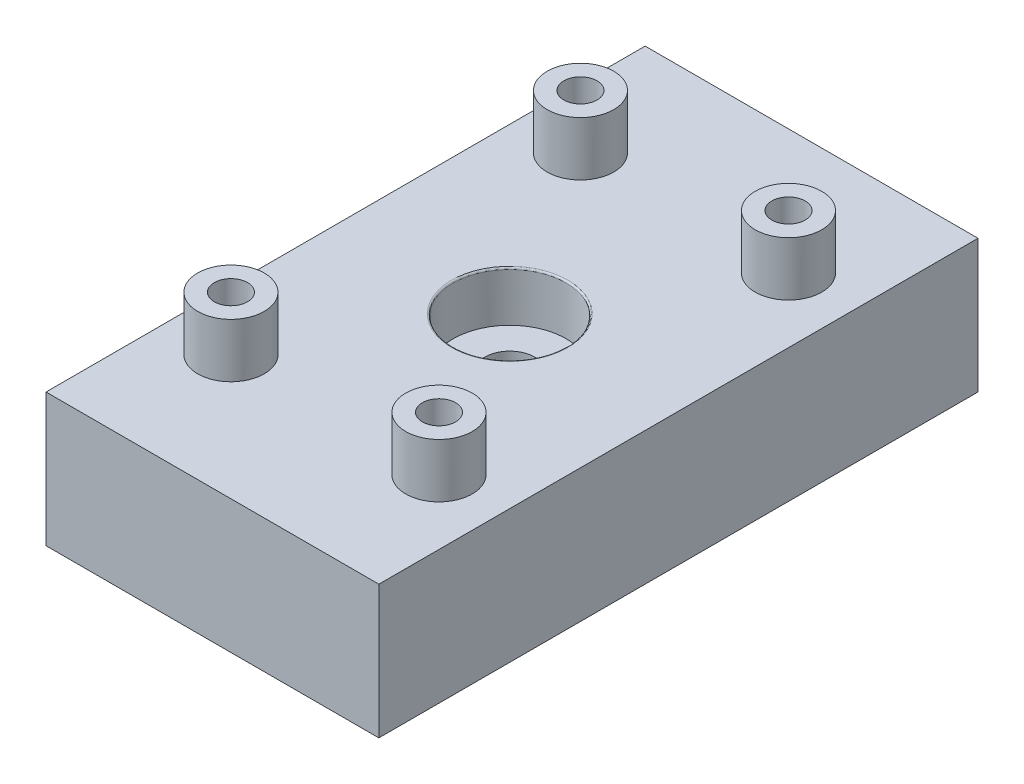
ISO-10303-21;
HEADER;
FILE_DESCRIPTION(('STEP AP214'),'2;1');
FILE_NAME('part.step','',(''),(''),'','','');
FILE_SCHEMA(('AUTOMOTIVE_DESIGN { 1 0 10303 214 1 1 1 1 }'));
ENDSEC;
DATA;
#1=APPLICATION_CONTEXT('core data for automotive mechanical design processes');
#2=APPLICATION_PROTOCOL_DEFINITION('international standard','automotive_design',2000,#1);
#3=PRODUCT_CONTEXT('',#1,'mechanical');
#4=PRODUCT('Part','Part','',(#3));
#5=PRODUCT_RELATED_PRODUCT_CATEGORY('part','',(#4));
#6=PRODUCT_DEFINITION_FORMATION('','',#4);
#7=PRODUCT_DEFINITION_CONTEXT('part definition',#1,'design');
#8=PRODUCT_DEFINITION('design','',#6,#7);
#9=PRODUCT_DEFINITION_SHAPE('','',#8);
#10=(LENGTH_UNIT() NAMED_UNIT(*) SI_UNIT(.MILLI.,.METRE.));
#11=(NAMED_UNIT(*) PLANE_ANGLE_UNIT() SI_UNIT($,.RADIAN.));
#12=(NAMED_UNIT(*) SI_UNIT($,.STERADIAN.) SOLID_ANGLE_UNIT());
#13=UNCERTAINTY_MEASURE_WITH_UNIT(LENGTH_MEASURE(1.E-05),#10,'distance_accuracy_value','');
#14=(GEOMETRIC_REPRESENTATION_CONTEXT(3) GLOBAL_UNCERTAINTY_ASSIGNED_CONTEXT((#13)) GLOBAL_UNIT_ASSIGNED_CONTEXT((#10,
#11,#12)) REPRESENTATION_CONTEXT('',''));
#15=CARTESIAN_POINT('',(0.,0.,0.));
#16=DIRECTION('',(0.,0.,1.));
#17=DIRECTION('',(1.,0.,0.));
#18=AXIS2_PLACEMENT_3D('',#15,#16,#17);
#19=CARTESIAN_POINT('',(31.0000000000001,14.4551298552221,-16.5000000000003));
#20=DIRECTION('',(0.,-1.,0.));
#21=DIRECTION('',(0.,0.,-1.));
#22=AXIS2_PLACEMENT_3D('',#19,#20,#21);
#23=CYLINDRICAL_SURFACE('',#22,1.5);
#24=CARTESIAN_POINT('',(31.0000000000001,-0.999999999999996,-16.5000000000003));
#25=DIRECTION('',(0.,-1.,0.));
#26=DIRECTION('',(0.,0.,-1.));
#27=AXIS2_PLACEMENT_3D('',#24,#25,#26);
#28=CIRCLE('',#27,1.5);
#29=CARTESIAN_POINT('',(31.0000000000001,-0.999999999999996,-18.0000000000003));
#30=VERTEX_POINT('',#29);
#31=EDGE_CURVE('E216',#30,#30,#28,.T.);
#32=ORIENTED_EDGE('',*,*,#31,.T.);
#33=EDGE_LOOP('',(#32));
#34=FACE_BOUND('',#33,.T.);
#35=CARTESIAN_POINT('',(31.0000000000001,2.,-16.5000000000003));
#36=DIRECTION('',(0.,1.,0.));
#37=DIRECTION('',(0.,0.,1.));
#38=AXIS2_PLACEMENT_3D('',#35,#36,#37);
#39=CIRCLE('',#38,1.5);
#40=CARTESIAN_POINT('',(31.0000000000001,2.,-15.0000000000002));
#41=VERTEX_POINT('',#40);
#42=EDGE_CURVE('E251',#41,#41,#39,.F.);
#43=ORIENTED_EDGE('',*,*,#42,.F.);
#44=EDGE_LOOP('',(#43));
#45=FACE_BOUND('',#44,.T.);
#46=ADVANCED_FACE('F35',(#34,#45),#23,.F.);
#47=CARTESIAN_POINT('',(28.5645960783532,-56.0190810887544,-3.41619309514644));
#48=DIRECTION('',(0.992924288528238,0.,-0.118749135789247));
#49=DIRECTION('',(-0.118749135789247,0.,-0.992924288528238));
#50=AXIS2_PLACEMENT_3D('',#47,#48,#49);
#51=PLANE('',#50);
#52=DIRECTION('',(-0.118749135789247,0.,-0.992924288528238));
#53=VECTOR('',#52,1.);
#54=CARTESIAN_POINT('',(25.3465622169513,-0.999999999999996,-30.3238750842019));
#55=LINE('',#54,#53);
#56=CARTESIAN_POINT('',(28.7659203508116,-0.999999999999994,-1.73281444429887));
#57=VERTEX_POINT('',#56);
#58=CARTESIAN_POINT('',(27.0000002429628,-0.999999999999994,-16.4986058332608));
#59=VERTEX_POINT('',#58);
#60=EDGE_CURVE('E236',#57,#59,#55,.T.);
#61=ORIENTED_EDGE('',*,*,#60,.F.);
#62=DIRECTION('',(0.,1.,0.));
#63=VECTOR('',#62,1.);
#64=CARTESIAN_POINT('',(28.7659203508116,-56.0190810887544,-1.73281444429887));
#65=LINE('',#64,#63);
#66=CARTESIAN_POINT('',(28.7659203508116,-3.,-1.73281444429887));
#67=VERTEX_POINT('',#66);
#68=EDGE_CURVE('E50',#67,#57,#65,.T.);
#69=ORIENTED_EDGE('',*,*,#68,.F.);
#70=DIRECTION('',(-0.118749135789247,0.,-0.992924288528238));
#71=VECTOR('',#70,1.);
#72=CARTESIAN_POINT('',(28.5645960783532,-3.,-3.41619309514644));
#73=LINE('',#72,#71);
#74=CARTESIAN_POINT('',(27.0000002429628,-3.,-16.4986058332608));
#75=VERTEX_POINT('',#74);
#76=EDGE_CURVE('E213',#67,#75,#73,.T.);
#77=ORIENTED_EDGE('',*,*,#76,.T.);
#78=DIRECTION('',(0.,1.,0.));
#79=VECTOR('',#78,1.);
#80=CARTESIAN_POINT('',(27.0000002429628,-56.0190810887544,-16.4986058332608));
#81=LINE('',#80,#79);
#82=EDGE_CURVE('E194',#75,#59,#81,.T.);
#83=ORIENTED_EDGE('',*,*,#82,.T.);
#84=EDGE_LOOP('',(#61,#69,#77,#83));
#85=FACE_BOUND('',#84,.T.);
#86=ADVANCED_FACE('F270',(#85),#51,.T.);
#87=CARTESIAN_POINT('',(31.0000000000001,-56.0190810887544,-16.5000000000003));
#88=DIRECTION('',(0.,1.,0.));
#89=DIRECTION('',(0.,0.,1.));
#90=AXIS2_PLACEMENT_3D('',#87,#88,#89);
#91=CYLINDRICAL_SURFACE('',#90,4.);
#92=CARTESIAN_POINT('',(31.0000000000001,-0.999999999999994,-16.5000000000003));
#93=DIRECTION('',(0.,1.,0.));
#94=DIRECTION('',(0.,0.,1.));
#95=AXIS2_PLACEMENT_3D('',#92,#93,#94);
#96=CIRCLE('',#95,4.);
#97=CARTESIAN_POINT('',(27.0114563028361,-0.999999999999994,-16.8025213642265));
#98=VERTEX_POINT('',#97);
#99=EDGE_CURVE('E58',#59,#98,#96,.F.);
#100=ORIENTED_EDGE('',*,*,#99,.F.);
#101=ORIENTED_EDGE('',*,*,#82,.F.);
#102=CARTESIAN_POINT('',(31.0000000000001,-3.,-16.5000000000003));
#103=DIRECTION('',(0.,-1.,0.));
#104=DIRECTION('',(0.,0.,-1.));
#105=AXIS2_PLACEMENT_3D('',#102,#103,#104);
#106=CIRCLE('',#105,4.);
#107=CARTESIAN_POINT('',(27.0114563028361,-3.,-16.8025213642265));
#108=VERTEX_POINT('',#107);
#109=EDGE_CURVE('E137',#75,#108,#106,.T.);
#110=ORIENTED_EDGE('',*,*,#109,.T.);
#111=DIRECTION('',(0.,1.,0.));
#112=VECTOR('',#111,1.);
#113=CARTESIAN_POINT('',(27.0114563028361,-56.0190810887544,-16.8025213642265));
#114=LINE('',#113,#112);
#115=EDGE_CURVE('E196',#108,#98,#114,.T.);
#116=ORIENTED_EDGE('',*,*,#115,.T.);
#117=EDGE_LOOP('',(#100,#101,#110,#116));
#118=FACE_BOUND('',#117,.T.);
#119=ADVANCED_FACE('F276',(#118),#91,.F.);
#120=CARTESIAN_POINT('',(24.6185809930788,-56.0190810887544,2.97812311791838));
#121=DIRECTION('',(-0.992762403209502,0.,-0.120095007280461));
#122=DIRECTION('',(-0.120095007280461,0.,0.992762403209502));
#123=AXIS2_PLACEMENT_3D('',#120,#121,#122);
#124=PLANE('',#123);
#125=DIRECTION('',(0.,1.,0.));
#126=VECTOR('',#125,1.);
#127=CARTESIAN_POINT('',(28.761775709795,-56.0190810887544,-31.2714933905052));
#128=LINE('',#127,#126);
#129=CARTESIAN_POINT('',(28.761775709795,-3.,-31.2714933905052));
#130=VERTEX_POINT('',#129);
#131=CARTESIAN_POINT('',(28.761775709795,-0.999999999999994,-31.2714933905052));
#132=VERTEX_POINT('',#131);
#133=EDGE_CURVE('E198',#130,#132,#128,.T.);
#134=ORIENTED_EDGE('',*,*,#133,.T.);
#135=DIRECTION('',(-0.120095007280461,0.,0.992762403209502));
#136=VECTOR('',#135,1.);
#137=CARTESIAN_POINT('',(28.7616881763409,-0.999999999999996,-31.270769797375));
#138=LINE('',#137,#136);
#139=EDGE_CURVE('E233',#132,#98,#138,.T.);
#140=ORIENTED_EDGE('',*,*,#139,.T.);
#141=ORIENTED_EDGE('',*,*,#115,.F.);
#142=DIRECTION('',(-0.120095007280461,0.,0.992762403209502));
#143=VECTOR('',#142,1.);
#144=CARTESIAN_POINT('',(24.6185809930788,-3.,2.97812311791838));
#145=LINE('',#144,#143);
#146=EDGE_CURVE('E174',#130,#108,#145,.T.);
#147=ORIENTED_EDGE('',*,*,#146,.F.);
#148=EDGE_LOOP('',(#134,#140,#141,#147));
#149=FACE_BOUND('',#148,.T.);
#150=ADVANCED_FACE('F310',(#149),#124,.F.);
#151=CARTESIAN_POINT('',(30.9954911170164,-56.0190810887544,-31.0012796241242));
#152=DIRECTION('',(0.,1.,0.));
#153=DIRECTION('',(0.,0.,1.));
#154=AXIS2_PLACEMENT_3D('',#151,#152,#153);
#155=CYLINDRICAL_SURFACE('',#154,2.25000000000001);
#156=CARTESIAN_POINT('',(30.9954911170164,-0.999999999999994,-31.0012796241242));
#157=DIRECTION('',(0.,1.,0.));
#158=DIRECTION('',(0.,0.,1.));
#159=AXIS2_PLACEMENT_3D('',#156,#157,#158);
#160=CIRCLE('',#159,2.25000000000001);
#161=CARTESIAN_POINT('',(33.2289626448358,-0.999999999999994,-31.2735018392727));
#162=VERTEX_POINT('',#161);
#163=EDGE_CURVE('E230',#132,#162,#160,.F.);
#164=ORIENTED_EDGE('',*,*,#163,.F.);
#165=ORIENTED_EDGE('',*,*,#133,.F.);
#166=CARTESIAN_POINT('',(30.9954911170164,-3.,-31.0012796241242));
#167=DIRECTION('',(0.,-1.,0.));
#168=DIRECTION('',(0.,0.,-1.));
#169=AXIS2_PLACEMENT_3D('',#166,#167,#168);
#170=CIRCLE('',#169,2.25000000000001);
#171=CARTESIAN_POINT('',(33.2289626448357,-3.,-31.2735018392727));
#172=VERTEX_POINT('',#171);
#173=EDGE_CURVE('E176',#130,#172,#170,.T.);
#174=ORIENTED_EDGE('',*,*,#173,.T.);
#175=DIRECTION('',(0.,1.,0.));
#176=VECTOR('',#175,1.);
#177=CARTESIAN_POINT('',(33.2289626448358,-56.0190810887544,-31.2735018392727));
#178=LINE('',#177,#176);
#179=EDGE_CURVE('E201',#172,#162,#178,.T.);
#180=ORIENTED_EDGE('',*,*,#179,.T.);
#181=EDGE_LOOP('',(#164,#165,#174,#180));
#182=FACE_BOUND('',#181,.T.);
#183=ADVANCED_FACE('F313',(#182),#155,.F.);
#184=CARTESIAN_POINT('',(36.498469162492,-56.0190810887544,-4.448542997386));
#185=DIRECTION('',(-0.992654012364151,0.,0.120987651177098));
#186=DIRECTION('',(0.120987651177098,0.,0.992654012364151));
#187=AXIS2_PLACEMENT_3D('',#184,#185,#186);
#188=PLANE('',#187);
#189=DIRECTION('',(0.120987651177098,0.,0.992654012364151));
#190=VECTOR('',#189,1.);
#191=CARTESIAN_POINT('',(33.2291823273386,-0.999999999999996,-31.2716994345171));
#192=LINE('',#191,#190);
#193=CARTESIAN_POINT('',(34.9706160494567,-0.999999999999994,-16.9839506047086));
#194=VERTEX_POINT('',#193);
#195=EDGE_CURVE('E227',#162,#194,#192,.T.);
#196=ORIENTED_EDGE('',*,*,#195,.F.);
#197=ORIENTED_EDGE('',*,*,#179,.F.);
#198=DIRECTION('',(0.120987651177098,0.,0.992654012364151));
#199=VECTOR('',#198,1.);
#200=CARTESIAN_POINT('',(36.498469162492,-3.,-4.448542997386));
#201=LINE('',#200,#199);
#202=CARTESIAN_POINT('',(34.9706160494567,-3.,-16.9839506047086));
#203=VERTEX_POINT('',#202);
#204=EDGE_CURVE('E179',#172,#203,#201,.T.);
#205=ORIENTED_EDGE('',*,*,#204,.T.);
#206=DIRECTION('',(0.,1.,0.));
#207=VECTOR('',#206,1.);
#208=CARTESIAN_POINT('',(34.9706160494567,-56.0190810887544,-16.9839506047086));
#209=LINE('',#208,#207);
#210=EDGE_CURVE('E204',#203,#194,#209,.T.);
#211=ORIENTED_EDGE('',*,*,#210,.T.);
#212=EDGE_LOOP('',(#196,#197,#205,#211));
#213=FACE_BOUND('',#212,.T.);
#214=ADVANCED_FACE('F316',(#213),#188,.T.);
#215=CARTESIAN_POINT('',(31.0000000000001,-56.0190810887544,-16.5000000000003));
#216=DIRECTION('',(0.,1.,0.));
#217=DIRECTION('',(0.,0.,1.));
#218=AXIS2_PLACEMENT_3D('',#215,#216,#217);
#219=CYLINDRICAL_SURFACE('',#218,4.);
#220=CARTESIAN_POINT('',(31.0000000000001,-0.999999999999994,-16.5000000000003));
#221=DIRECTION('',(0.,1.,0.));
#222=DIRECTION('',(0.,0.,1.));
#223=AXIS2_PLACEMENT_3D('',#220,#221,#222);
#224=CIRCLE('',#223,4.);
#225=CARTESIAN_POINT('',(34.9707611504794,-0.999999999999994,-16.0172413793164));
#226=VERTEX_POINT('',#225);
#227=EDGE_CURVE('E224',#194,#226,#224,.F.);
#228=ORIENTED_EDGE('',*,*,#227,.F.);
#229=ORIENTED_EDGE('',*,*,#210,.F.);
#230=CARTESIAN_POINT('',(31.0000000000001,-3.,-16.5000000000003));
#231=DIRECTION('',(0.,-1.,0.));
#232=DIRECTION('',(0.,0.,-1.));
#233=AXIS2_PLACEMENT_3D('',#230,#231,#232);
#234=CIRCLE('',#233,4.);
#235=CARTESIAN_POINT('',(34.9707611504794,-3.,-16.0172413793164));
#236=VERTEX_POINT('',#235);
#237=EDGE_CURVE('E182',#203,#236,#234,.T.);
#238=ORIENTED_EDGE('',*,*,#237,.T.);
#239=DIRECTION('',(0.,1.,0.));
#240=VECTOR('',#239,1.);
#241=CARTESIAN_POINT('',(34.9707611504794,-56.0190810887544,-16.0172413793164));
#242=LINE('',#241,#240);
#243=EDGE_CURVE('E207',#236,#226,#242,.T.);
#244=ORIENTED_EDGE('',*,*,#243,.T.);
#245=EDGE_LOOP('',(#228,#229,#238,#244));
#246=FACE_BOUND('',#245,.T.);
#247=ADVANCED_FACE('F318',(#246),#219,.F.);
#248=CARTESIAN_POINT('',(32.5423924713332,-56.0190810887544,3.95645064204272));
#249=DIRECTION('',(0.992690287619818,0.,0.120689655170953));
#250=DIRECTION('',(0.120689655170953,0.,-0.992690287619818));
#251=AXIS2_PLACEMENT_3D('',#248,#249,#250);
#252=PLANE('',#251);
#253=DIRECTION('',(0.,1.,0.));
#254=VECTOR('',#253,1.);
#255=CARTESIAN_POINT('',(33.2335531471447,-56.0190810887544,-1.72844827569003));
#256=LINE('',#255,#254);
#257=CARTESIAN_POINT('',(33.2335531471447,-3.,-1.72844827569003));
#258=VERTEX_POINT('',#257);
#259=CARTESIAN_POINT('',(33.2335531471447,-0.999999999999994,-1.72844827569003));
#260=VERTEX_POINT('',#259);
#261=EDGE_CURVE('E210',#258,#260,#256,.T.);
#262=ORIENTED_EDGE('',*,*,#261,.T.);
#263=DIRECTION('',(0.120689655170953,0.,-0.992690287619818));
#264=VECTOR('',#263,1.);
#265=CARTESIAN_POINT('',(36.7079691537931,-0.999999999999996,-30.3060344827698));
#266=LINE('',#265,#264);
#267=EDGE_CURVE('E222',#260,#226,#266,.T.);
#268=ORIENTED_EDGE('',*,*,#267,.T.);
#269=ORIENTED_EDGE('',*,*,#243,.F.);
#270=DIRECTION('',(0.120689655170953,0.,-0.992690287619818));
#271=VECTOR('',#270,1.);
#272=CARTESIAN_POINT('',(32.5423924713332,-3.,3.95645064204272));
#273=LINE('',#272,#271);
#274=EDGE_CURVE('E185',#258,#236,#273,.T.);
#275=ORIENTED_EDGE('',*,*,#274,.F.);
#276=EDGE_LOOP('',(#262,#268,#269,#275));
#277=FACE_BOUND('',#276,.T.);
#278=ADVANCED_FACE('F302',(#277),#252,.F.);
#279=CARTESIAN_POINT('',(31.0000000000001,-56.0190810887544,-1.99999999982468));
#280=DIRECTION('',(0.,1.,0.));
#281=DIRECTION('',(0.,0.,1.));
#282=AXIS2_PLACEMENT_3D('',#279,#280,#281);
#283=CYLINDRICAL_SURFACE('',#282,2.25);
#284=CARTESIAN_POINT('',(31.0000000000001,-0.999999999999994,-1.99999999982468));
#285=DIRECTION('',(0.,1.,0.));
#286=DIRECTION('',(0.,0.,1.));
#287=AXIS2_PLACEMENT_3D('',#284,#285,#286);
#288=CIRCLE('',#287,2.25);
#289=EDGE_CURVE('E219',#260,#57,#288,.F.);
#290=ORIENTED_EDGE('',*,*,#289,.F.);
#291=ORIENTED_EDGE('',*,*,#261,.F.);
#292=CARTESIAN_POINT('',(31.0000000000001,-3.,-1.99999999982468));
#293=DIRECTION('',(0.,-1.,0.));
#294=DIRECTION('',(0.,0.,-1.));
#295=AXIS2_PLACEMENT_3D('',#292,#293,#294);
#296=CIRCLE('',#295,2.25);
#297=EDGE_CURVE('E187',#258,#67,#296,.T.);
#298=ORIENTED_EDGE('',*,*,#297,.T.);
#299=ORIENTED_EDGE('',*,*,#68,.T.);
#300=EDGE_LOOP('',(#290,#291,#298,#299));
#301=FACE_BOUND('',#300,.T.);
#302=ADVANCED_FACE('F299',(#301),#283,.F.);
#303=CARTESIAN_POINT('',(21.1372206394749,-56.0190810887544,0.));
#304=DIRECTION('',(1.,0.,0.));
#305=DIRECTION('',(0.,0.,-1.));
#306=AXIS2_PLACEMENT_3D('',#303,#304,#305);
#307=PLANE('',#306);
#308=DIRECTION('',(0.,0.,-1.));
#309=VECTOR('',#308,1.);
#310=CARTESIAN_POINT('',(21.1372206394749,-3.,0.));
#311=LINE('',#310,#309);
#312=CARTESIAN_POINT('',(21.1372206394749,-3.,1.49999999999975));
#313=VERTEX_POINT('',#312);
#314=CARTESIAN_POINT('',(21.1372206394749,-3.,-34.5000000000003));
#315=VERTEX_POINT('',#314);
#316=EDGE_CURVE('E134',#313,#315,#311,.T.);
#317=ORIENTED_EDGE('',*,*,#316,.F.);
#318=DIRECTION('',(0.,1.,0.));
#319=VECTOR('',#318,1.);
#320=CARTESIAN_POINT('',(21.1372206394749,-56.0190810887544,1.49999999999975));
#321=LINE('',#320,#319);
#322=CARTESIAN_POINT('',(21.1372206394749,5.,1.49999999999975));
#323=VERTEX_POINT('',#322);
#324=EDGE_CURVE('E127',#313,#323,#321,.T.);
#325=ORIENTED_EDGE('',*,*,#324,.T.);
#326=DIRECTION('',(0.,0.,1.));
#327=VECTOR('',#326,1.);
#328=CARTESIAN_POINT('',(21.1372206394749,5.,1.49999999999975));
#329=LINE('',#328,#327);
#330=CARTESIAN_POINT('',(21.1372206394749,5.,-34.5000000000003));
#331=VERTEX_POINT('',#330);
#332=EDGE_CURVE('E132',#331,#323,#329,.T.);
#333=ORIENTED_EDGE('',*,*,#332,.F.);
#334=DIRECTION('',(0.,-1.,0.));
#335=VECTOR('',#334,1.);
#336=CARTESIAN_POINT('',(21.1372206394749,-56.0190810887544,-34.5000000000003));
#337=LINE('',#336,#335);
#338=EDGE_CURVE('E168',#331,#315,#337,.T.);
#339=ORIENTED_EDGE('',*,*,#338,.T.);
#340=EDGE_LOOP('',(#317,#325,#333,#339));
#341=FACE_BOUND('',#340,.T.);
#342=ADVANCED_FACE('F129',(#341),#307,.F.);
#343=CARTESIAN_POINT('',(41.1372206394749,-56.0190810887544,0.));
#344=DIRECTION('',(-1.,0.,0.));
#345=DIRECTION('',(0.,0.,1.));
#346=AXIS2_PLACEMENT_3D('',#343,#344,#345);
#347=PLANE('',#346);
#348=DIRECTION('',(0.,1.,0.));
#349=VECTOR('',#348,1.);
#350=CARTESIAN_POINT('',(41.1372206394749,-56.0190810887544,-34.5000000000003));
#351=LINE('',#350,#349);
#352=CARTESIAN_POINT('',(41.1372206394749,-3.,-34.5000000000003));
#353=VERTEX_POINT('',#352);
#354=CARTESIAN_POINT('',(41.1372206394749,5.,-34.5000000000003));
#355=VERTEX_POINT('',#354);
#356=EDGE_CURVE('E164',#353,#355,#351,.T.);
#357=ORIENTED_EDGE('',*,*,#356,.T.);
#358=DIRECTION('',(0.,0.,-1.));
#359=VECTOR('',#358,1.);
#360=CARTESIAN_POINT('',(41.1372206394749,5.,-34.5000000000003));
#361=LINE('',#360,#359);
#362=CARTESIAN_POINT('',(41.1372206394749,5.,1.49999999999975));
#363=VERTEX_POINT('',#362);
#364=EDGE_CURVE('E148',#363,#355,#361,.T.);
#365=ORIENTED_EDGE('',*,*,#364,.F.);
#366=DIRECTION('',(0.,-1.,0.));
#367=VECTOR('',#366,1.);
#368=CARTESIAN_POINT('',(41.1372206394749,-56.0190810887544,1.49999999999975));
#369=LINE('',#368,#367);
#370=CARTESIAN_POINT('',(41.1372206394749,-3.,1.49999999999975));
#371=VERTEX_POINT('',#370);
#372=EDGE_CURVE('E144',#363,#371,#369,.T.);
#373=ORIENTED_EDGE('',*,*,#372,.T.);
#374=DIRECTION('',(0.,0.,1.));
#375=VECTOR('',#374,1.);
#376=CARTESIAN_POINT('',(41.1372206394749,-3.,0.));
#377=LINE('',#376,#375);
#378=EDGE_CURVE('E190',#353,#371,#377,.T.);
#379=ORIENTED_EDGE('',*,*,#378,.F.);
#380=EDGE_LOOP('',(#357,#365,#373,#379));
#381=FACE_BOUND('',#380,.T.);
#382=ADVANCED_FACE('F282',(#381),#347,.F.);
#383=CARTESIAN_POINT('',(0.,-3.,0.));
#384=DIRECTION('',(0.,-1.,0.));
#385=DIRECTION('',(0.,0.,-1.));
#386=AXIS2_PLACEMENT_3D('',#383,#384,#385);
#387=PLANE('',#386);
#388=DIRECTION('',(1.,0.,0.));
#389=VECTOR('',#388,1.);
#390=CARTESIAN_POINT('',(0.,-3.,1.49999999999975));
#391=LINE('',#390,#389);
#392=EDGE_CURVE('E138',#313,#371,#391,.T.);
#393=ORIENTED_EDGE('',*,*,#392,.F.);
#394=ORIENTED_EDGE('',*,*,#316,.T.);
#395=DIRECTION('',(-1.,0.,0.));
#396=VECTOR('',#395,1.);
#397=CARTESIAN_POINT('',(0.,-3.,-34.5000000000003));
#398=LINE('',#397,#396);
#399=EDGE_CURVE('E166',#353,#315,#398,.T.);
#400=ORIENTED_EDGE('',*,*,#399,.F.);
#401=ORIENTED_EDGE('',*,*,#378,.T.);
#402=EDGE_LOOP('',(#393,#394,#400,#401));
#403=FACE_BOUND('',#402,.T.);
#404=ORIENTED_EDGE('',*,*,#297,.F.);
#405=ORIENTED_EDGE('',*,*,#274,.T.);
#406=ORIENTED_EDGE('',*,*,#237,.F.);
#407=ORIENTED_EDGE('',*,*,#204,.F.);
#408=ORIENTED_EDGE('',*,*,#173,.F.);
#409=ORIENTED_EDGE('',*,*,#146,.T.);
#410=ORIENTED_EDGE('',*,*,#109,.F.);
#411=ORIENTED_EDGE('',*,*,#76,.F.);
#412=EDGE_LOOP('',(#404,#405,#406,#407,#408,#409,#410,#411));
#413=FACE_BOUND('',#412,.T.);
#414=ADVANCED_FACE('F284',(#403,#413),#387,.T.);
#415=CARTESIAN_POINT('',(31.0000000000001,-0.999999999999996,-31.0000000000003));
#416=DIRECTION('',(0.,1.,0.));
#417=DIRECTION('',(0.,0.,1.));
#418=AXIS2_PLACEMENT_3D('',#415,#416,#417);
#419=PLANE('',#418);
#420=ORIENTED_EDGE('',*,*,#31,.F.);
#421=EDGE_LOOP('',(#420));
#422=FACE_BOUND('',#421,.T.);
#423=ORIENTED_EDGE('',*,*,#289,.T.);
#424=ORIENTED_EDGE('',*,*,#60,.T.);
#425=ORIENTED_EDGE('',*,*,#99,.T.);
#426=ORIENTED_EDGE('',*,*,#139,.F.);
#427=ORIENTED_EDGE('',*,*,#163,.T.);
#428=ORIENTED_EDGE('',*,*,#195,.T.);
#429=ORIENTED_EDGE('',*,*,#227,.T.);
#430=ORIENTED_EDGE('',*,*,#267,.F.);
#431=EDGE_LOOP('',(#423,#424,#425,#426,#427,#428,#429,#430));
#432=FACE_BOUND('',#431,.T.);
#433=ADVANCED_FACE('F286',(#422,#432),#419,.F.);
#434=CARTESIAN_POINT('',(0.,-11.,1.49999999999975));
#435=DIRECTION('',(0.,0.,-1.));
#436=DIRECTION('',(-1.,0.,0.));
#437=AXIS2_PLACEMENT_3D('',#434,#435,#436);
#438=PLANE('',#437);
#439=ORIENTED_EDGE('',*,*,#372,.F.);
#440=DIRECTION('',(1.,0.,0.));
#441=VECTOR('',#440,1.);
#442=CARTESIAN_POINT('',(41.1372206394749,5.,1.49999999999975));
#443=LINE('',#442,#441);
#444=EDGE_CURVE('E141',#323,#363,#443,.T.);
#445=ORIENTED_EDGE('',*,*,#444,.F.);
#446=ORIENTED_EDGE('',*,*,#324,.F.);
#447=ORIENTED_EDGE('',*,*,#392,.T.);
#448=EDGE_LOOP('',(#439,#445,#446,#447));
#449=FACE_BOUND('',#448,.T.);
#450=ADVANCED_FACE('F142',(#449),#438,.F.);
#451=CARTESIAN_POINT('',(0.,-11.,-34.5000000000003));
#452=DIRECTION('',(0.,0.,1.));
#453=DIRECTION('',(1.,0.,0.));
#454=AXIS2_PLACEMENT_3D('',#451,#452,#453);
#455=PLANE('',#454);
#456=ORIENTED_EDGE('',*,*,#338,.F.);
#457=DIRECTION('',(-1.,0.,0.));
#458=VECTOR('',#457,1.);
#459=CARTESIAN_POINT('',(21.1372206394749,5.,-34.5000000000003));
#460=LINE('',#459,#458);
#461=EDGE_CURVE('E154',#355,#331,#460,.T.);
#462=ORIENTED_EDGE('',*,*,#461,.F.);
#463=ORIENTED_EDGE('',*,*,#356,.F.);
#464=ORIENTED_EDGE('',*,*,#399,.T.);
#465=EDGE_LOOP('',(#456,#462,#463,#464));
#466=FACE_BOUND('',#465,.T.);
#467=ADVANCED_FACE('F293',(#466),#455,.F.);
#468=CARTESIAN_POINT('',(0.,5.,0.));
#469=DIRECTION('',(0.,-1.,0.));
#470=DIRECTION('',(0.,0.,-1.));
#471=AXIS2_PLACEMENT_3D('',#468,#469,#470);
#472=PLANE('',#471);
#473=CARTESIAN_POINT('',(31.0000000000001,5.,-16.5000000000003));
#474=DIRECTION('',(0.,-1.,0.));
#475=DIRECTION('',(0.,0.,-1.));
#476=AXIS2_PLACEMENT_3D('',#473,#474,#475);
#477=CIRCLE('',#476,3.5);
#478=CARTESIAN_POINT('',(31.0000000000001,5.,-20.0000000000002));
#479=VERTEX_POINT('',#478);
#480=EDGE_CURVE('E11',#479,#479,#477,.T.);
#481=ORIENTED_EDGE('',*,*,#480,.T.);
#482=EDGE_LOOP('',(#481));
#483=FACE_BOUND('',#482,.T.);
#484=CARTESIAN_POINT('',(37.2500000000001,5.,-27.0000000000003));
#485=DIRECTION('',(0.,-1.,0.));
#486=DIRECTION('',(0.,0.,-1.));
#487=AXIS2_PLACEMENT_3D('',#484,#485,#486);
#488=CIRCLE('',#487,2.);
#489=CARTESIAN_POINT('',(37.2500000000001,5.,-29.0000000000003));
#490=VERTEX_POINT('',#489);
#491=EDGE_CURVE('E248',#490,#490,#488,.F.);
#492=ORIENTED_EDGE('',*,*,#491,.F.);
#493=EDGE_LOOP('',(#492));
#494=FACE_BOUND('',#493,.T.);
#495=CARTESIAN_POINT('',(37.2500000000001,5.,-6.00000000000025));
#496=DIRECTION('',(0.,-1.,0.));
#497=DIRECTION('',(0.,0.,-1.));
#498=AXIS2_PLACEMENT_3D('',#495,#496,#497);
#499=CIRCLE('',#498,2.);
#500=CARTESIAN_POINT('',(37.2500000000001,5.,-8.00000000000025));
#501=VERTEX_POINT('',#500);
#502=EDGE_CURVE('E239',#501,#501,#499,.F.);
#503=ORIENTED_EDGE('',*,*,#502,.F.);
#504=EDGE_LOOP('',(#503));
#505=FACE_BOUND('',#504,.T.);
#506=ORIENTED_EDGE('',*,*,#332,.T.);
#507=ORIENTED_EDGE('',*,*,#444,.T.);
#508=ORIENTED_EDGE('',*,*,#364,.T.);
#509=ORIENTED_EDGE('',*,*,#461,.T.);
#510=EDGE_LOOP('',(#506,#507,#508,#509));
#511=FACE_BOUND('',#510,.T.);
#512=CARTESIAN_POINT('',(24.7500000000001,5.,-6.00000000000025));
#513=DIRECTION('',(0.,-1.,0.));
#514=DIRECTION('',(0.,0.,-1.));
#515=AXIS2_PLACEMENT_3D('',#512,#513,#514);
#516=CIRCLE('',#515,2.);
#517=CARTESIAN_POINT('',(24.7500000000001,5.,-8.00000000000025));
#518=VERTEX_POINT('',#517);
#519=EDGE_CURVE('E242',#518,#518,#516,.F.);
#520=ORIENTED_EDGE('',*,*,#519,.F.);
#521=EDGE_LOOP('',(#520));
#522=FACE_BOUND('',#521,.T.);
#523=CARTESIAN_POINT('',(24.7500000000001,5.,-27.0000000000003));
#524=DIRECTION('',(0.,-1.,0.));
#525=DIRECTION('',(0.,0.,-1.));
#526=AXIS2_PLACEMENT_3D('',#523,#524,#525);
#527=CIRCLE('',#526,2.);
#528=CARTESIAN_POINT('',(24.7500000000001,5.,-29.0000000000003));
#529=VERTEX_POINT('',#528);
#530=EDGE_CURVE('E245',#529,#529,#527,.F.);
#531=ORIENTED_EDGE('',*,*,#530,.F.);
#532=EDGE_LOOP('',(#531));
#533=FACE_BOUND('',#532,.T.);
#534=ADVANCED_FACE('F151',(#483,#494,#505,#511,#522,#533),#472,.F.);
#535=CARTESIAN_POINT('',(37.2500000000001,8.25,-6.00000000000025));
#536=DIRECTION('',(0.,-1.,0.));
#537=DIRECTION('',(0.,0.,-1.));
#538=AXIS2_PLACEMENT_3D('',#535,#536,#537);
#539=CYLINDRICAL_SURFACE('',#538,2.);
#540=CARTESIAN_POINT('',(37.2500000000001,8.25,-6.00000000000025));
#541=DIRECTION('',(0.,1.,0.));
#542=DIRECTION('',(0.,0.,1.));
#543=AXIS2_PLACEMENT_3D('',#540,#541,#542);
#544=CIRCLE('',#543,2.);
#545=CARTESIAN_POINT('',(37.2500000000001,8.25,-4.00000000000025));
#546=VERTEX_POINT('',#545);
#547=EDGE_CURVE('E155',#546,#546,#544,.T.);
#548=ORIENTED_EDGE('',*,*,#547,.F.);
#549=EDGE_LOOP('',(#548));
#550=FACE_BOUND('',#549,.T.);
#551=ORIENTED_EDGE('',*,*,#502,.T.);
#552=EDGE_LOOP('',(#551));
#553=FACE_BOUND('',#552,.T.);
#554=ADVANCED_FACE('F345',(#550,#553),#539,.T.);
#555=CARTESIAN_POINT('',(37.2500000000001,8.25,-6.00000000000025));
#556=DIRECTION('',(0.,1.,0.));
#557=DIRECTION('',(0.,0.,1.));
#558=AXIS2_PLACEMENT_3D('',#555,#556,#557);
#559=PLANE('',#558);
#560=CARTESIAN_POINT('',(37.2500000000001,8.25,-6.00000000000025));
#561=DIRECTION('',(0.,1.,0.));
#562=DIRECTION('',(0.,0.,1.));
#563=AXIS2_PLACEMENT_3D('',#560,#561,#562);
#564=CIRCLE('',#563,0.999999999999998);
#565=CARTESIAN_POINT('',(37.2500000000001,8.25,-5.00000000000025));
#566=VERTEX_POINT('',#565);
#567=EDGE_CURVE('E616',#566,#566,#564,.T.);
#568=ORIENTED_EDGE('',*,*,#567,.F.);
#569=EDGE_LOOP('',(#568));
#570=FACE_BOUND('',#569,.T.);
#571=ORIENTED_EDGE('',*,*,#547,.T.);
#572=EDGE_LOOP('',(#571));
#573=FACE_BOUND('',#572,.T.);
#574=ADVANCED_FACE('F419',(#570,#573),#559,.T.);
#575=CARTESIAN_POINT('',(24.7500000000001,8.25,-6.00000000000025));
#576=DIRECTION('',(0.,-1.,0.));
#577=DIRECTION('',(0.,0.,-1.));
#578=AXIS2_PLACEMENT_3D('',#575,#576,#577);
#579=CYLINDRICAL_SURFACE('',#578,2.);
#580=CARTESIAN_POINT('',(24.7500000000001,8.25,-6.00000000000025));
#581=DIRECTION('',(0.,1.,0.));
#582=DIRECTION('',(0.,0.,1.));
#583=AXIS2_PLACEMENT_3D('',#580,#581,#582);
#584=CIRCLE('',#583,2.);
#585=CARTESIAN_POINT('',(24.7500000000001,8.25,-4.00000000000025));
#586=VERTEX_POINT('',#585);
#587=EDGE_CURVE('E158',#586,#586,#584,.T.);
#588=ORIENTED_EDGE('',*,*,#587,.F.);
#589=EDGE_LOOP('',(#588));
#590=FACE_BOUND('',#589,.T.);
#591=ORIENTED_EDGE('',*,*,#519,.T.);
#592=EDGE_LOOP('',(#591));
#593=FACE_BOUND('',#592,.T.);
#594=ADVANCED_FACE('F413',(#590,#593),#579,.T.);
#595=CARTESIAN_POINT('',(24.7500000000001,8.25,-6.00000000000025));
#596=DIRECTION('',(0.,1.,0.));
#597=DIRECTION('',(0.,0.,1.));
#598=AXIS2_PLACEMENT_3D('',#595,#596,#597);
#599=PLANE('',#598);
#600=CARTESIAN_POINT('',(24.7500000000001,8.25,-6.00000000000025));
#601=DIRECTION('',(0.,1.,0.));
#602=DIRECTION('',(0.,0.,1.));
#603=AXIS2_PLACEMENT_3D('',#600,#601,#602);
#604=CIRCLE('',#603,1.);
#605=CARTESIAN_POINT('',(24.7500000000001,8.25,-5.00000000000025));
#606=VERTEX_POINT('',#605);
#607=EDGE_CURVE('E617',#606,#606,#604,.T.);
#608=ORIENTED_EDGE('',*,*,#607,.F.);
#609=EDGE_LOOP('',(#608));
#610=FACE_BOUND('',#609,.T.);
#611=ORIENTED_EDGE('',*,*,#587,.T.);
#612=EDGE_LOOP('',(#611));
#613=FACE_BOUND('',#612,.T.);
#614=ADVANCED_FACE('F418',(#610,#613),#599,.T.);
#615=CARTESIAN_POINT('',(24.7500000000001,8.25,-27.0000000000003));
#616=DIRECTION('',(0.,-1.,0.));
#617=DIRECTION('',(0.,0.,-1.));
#618=AXIS2_PLACEMENT_3D('',#615,#616,#617);
#619=CYLINDRICAL_SURFACE('',#618,2.);
#620=CARTESIAN_POINT('',(24.7500000000001,8.25,-27.0000000000003));
#621=DIRECTION('',(0.,1.,0.));
#622=DIRECTION('',(0.,0.,1.));
#623=AXIS2_PLACEMENT_3D('',#620,#621,#622);
#624=CIRCLE('',#623,2.);
#625=CARTESIAN_POINT('',(24.7500000000001,8.25,-25.0000000000003));
#626=VERTEX_POINT('',#625);
#627=EDGE_CURVE('E639',#626,#626,#624,.T.);
#628=ORIENTED_EDGE('',*,*,#627,.F.);
#629=EDGE_LOOP('',(#628));
#630=FACE_BOUND('',#629,.T.);
#631=ORIENTED_EDGE('',*,*,#530,.T.);
#632=EDGE_LOOP('',(#631));
#633=FACE_BOUND('',#632,.T.);
#634=ADVANCED_FACE('F429',(#630,#633),#619,.T.);
#635=CARTESIAN_POINT('',(24.7500000000001,8.25,-27.0000000000003));
#636=DIRECTION('',(0.,1.,0.));
#637=DIRECTION('',(0.,0.,1.));
#638=AXIS2_PLACEMENT_3D('',#635,#636,#637);
#639=PLANE('',#638);
#640=CARTESIAN_POINT('',(24.7500000000001,8.25,-27.0000000000003));
#641=DIRECTION('',(0.,1.,0.));
#642=DIRECTION('',(0.,0.,1.));
#643=AXIS2_PLACEMENT_3D('',#640,#641,#642);
#644=CIRCLE('',#643,1.);
#645=CARTESIAN_POINT('',(24.7500000000001,8.25,-26.0000000000003));
#646=VERTEX_POINT('',#645);
#647=EDGE_CURVE('E623',#646,#646,#644,.T.);
#648=ORIENTED_EDGE('',*,*,#647,.F.);
#649=EDGE_LOOP('',(#648));
#650=FACE_BOUND('',#649,.T.);
#651=ORIENTED_EDGE('',*,*,#627,.T.);
#652=EDGE_LOOP('',(#651));
#653=FACE_BOUND('',#652,.T.);
#654=ADVANCED_FACE('F434',(#650,#653),#639,.T.);
#655=CARTESIAN_POINT('',(37.2500000000001,8.25,-27.0000000000003));
#656=DIRECTION('',(0.,-1.,0.));
#657=DIRECTION('',(0.,0.,-1.));
#658=AXIS2_PLACEMENT_3D('',#655,#656,#657);
#659=CYLINDRICAL_SURFACE('',#658,2.);
#660=CARTESIAN_POINT('',(37.2500000000001,8.25,-27.0000000000003));
#661=DIRECTION('',(0.,1.,0.));
#662=DIRECTION('',(0.,0.,1.));
#663=AXIS2_PLACEMENT_3D('',#660,#661,#662);
#664=CIRCLE('',#663,2.);
#665=CARTESIAN_POINT('',(37.2500000000001,8.25,-25.0000000000003));
#666=VERTEX_POINT('',#665);
#667=EDGE_CURVE('E634',#666,#666,#664,.T.);
#668=ORIENTED_EDGE('',*,*,#667,.F.);
#669=EDGE_LOOP('',(#668));
#670=FACE_BOUND('',#669,.T.);
#671=ORIENTED_EDGE('',*,*,#491,.T.);
#672=EDGE_LOOP('',(#671));
#673=FACE_BOUND('',#672,.T.);
#674=ADVANCED_FACE('F458',(#670,#673),#659,.T.);
#675=CARTESIAN_POINT('',(37.2500000000001,8.25,-27.0000000000003));
#676=DIRECTION('',(0.,1.,0.));
#677=DIRECTION('',(0.,0.,1.));
#678=AXIS2_PLACEMENT_3D('',#675,#676,#677);
#679=PLANE('',#678);
#680=CARTESIAN_POINT('',(37.2500000000001,8.25,-27.0000000000003));
#681=DIRECTION('',(0.,1.,0.));
#682=DIRECTION('',(0.,0.,1.));
#683=AXIS2_PLACEMENT_3D('',#680,#681,#682);
#684=CIRCLE('',#683,0.999999999999998);
#685=CARTESIAN_POINT('',(37.2500000000001,8.25,-26.0000000000003));
#686=VERTEX_POINT('',#685);
#687=EDGE_CURVE('E253',#686,#686,#684,.T.);
#688=ORIENTED_EDGE('',*,*,#687,.F.);
#689=EDGE_LOOP('',(#688));
#690=FACE_BOUND('',#689,.T.);
#691=ORIENTED_EDGE('',*,*,#667,.T.);
#692=EDGE_LOOP('',(#691));
#693=FACE_BOUND('',#692,.T.);
#694=ADVANCED_FACE('F463',(#690,#693),#679,.T.);
#695=CARTESIAN_POINT('',(37.2500000000001,4.5,-27.0000000000003));
#696=DIRECTION('',(0.,1.,0.));
#697=DIRECTION('',(0.,0.,1.));
#698=AXIS2_PLACEMENT_3D('',#695,#696,#697);
#699=CYLINDRICAL_SURFACE('',#698,0.999999999999998);
#700=CARTESIAN_POINT('',(37.2500000000001,4.5,-27.0000000000003));
#701=DIRECTION('',(0.,1.,0.));
#702=DIRECTION('',(0.,0.,1.));
#703=AXIS2_PLACEMENT_3D('',#700,#701,#702);
#704=CIRCLE('',#703,0.999999999999998);
#705=CARTESIAN_POINT('',(37.2500000000001,4.5,-26.0000000000003));
#706=VERTEX_POINT('',#705);
#707=EDGE_CURVE('E626',#706,#706,#704,.T.);
#708=ORIENTED_EDGE('',*,*,#707,.F.);
#709=EDGE_LOOP('',(#708));
#710=FACE_BOUND('',#709,.T.);
#711=ORIENTED_EDGE('',*,*,#687,.T.);
#712=EDGE_LOOP('',(#711));
#713=FACE_BOUND('',#712,.T.);
#714=ADVANCED_FACE('F494',(#710,#713),#699,.F.);
#715=CARTESIAN_POINT('',(37.2500000000001,4.5,-27.0000000000003));
#716=DIRECTION('',(0.,1.,0.));
#717=DIRECTION('',(0.,0.,1.));
#718=AXIS2_PLACEMENT_3D('',#715,#716,#717);
#719=PLANE('',#718);
#720=ORIENTED_EDGE('',*,*,#707,.T.);
#721=EDGE_LOOP('',(#720));
#722=FACE_BOUND('',#721,.T.);
#723=ADVANCED_FACE('F504',(#722),#719,.T.);
#724=CARTESIAN_POINT('',(24.7500000000001,4.5,-27.0000000000003));
#725=DIRECTION('',(0.,1.,0.));
#726=DIRECTION('',(0.,0.,1.));
#727=AXIS2_PLACEMENT_3D('',#724,#725,#726);
#728=CYLINDRICAL_SURFACE('',#727,1.);
#729=CARTESIAN_POINT('',(24.7500000000001,4.5,-27.0000000000003));
#730=DIRECTION('',(0.,1.,0.));
#731=DIRECTION('',(0.,0.,1.));
#732=AXIS2_PLACEMENT_3D('',#729,#730,#731);
#733=CIRCLE('',#732,1.);
#734=CARTESIAN_POINT('',(24.7500000000001,4.5,-26.0000000000003));
#735=VERTEX_POINT('',#734);
#736=EDGE_CURVE('E620',#735,#735,#733,.T.);
#737=ORIENTED_EDGE('',*,*,#736,.F.);
#738=EDGE_LOOP('',(#737));
#739=FACE_BOUND('',#738,.T.);
#740=ORIENTED_EDGE('',*,*,#647,.T.);
#741=EDGE_LOOP('',(#740));
#742=FACE_BOUND('',#741,.T.);
#743=ADVANCED_FACE('F514',(#739,#742),#728,.F.);
#744=CARTESIAN_POINT('',(24.7500000000001,4.5,-27.0000000000003));
#745=DIRECTION('',(0.,1.,0.));
#746=DIRECTION('',(0.,0.,1.));
#747=AXIS2_PLACEMENT_3D('',#744,#745,#746);
#748=PLANE('',#747);
#749=ORIENTED_EDGE('',*,*,#736,.T.);
#750=EDGE_LOOP('',(#749));
#751=FACE_BOUND('',#750,.T.);
#752=ADVANCED_FACE('F524',(#751),#748,.T.);
#753=CARTESIAN_POINT('',(24.7500000000001,4.5,-6.00000000000025));
#754=DIRECTION('',(0.,1.,0.));
#755=DIRECTION('',(0.,0.,1.));
#756=AXIS2_PLACEMENT_3D('',#753,#754,#755);
#757=CYLINDRICAL_SURFACE('',#756,1.);
#758=CARTESIAN_POINT('',(24.7500000000001,4.5,-6.00000000000025));
#759=DIRECTION('',(0.,1.,0.));
#760=DIRECTION('',(0.,0.,1.));
#761=AXIS2_PLACEMENT_3D('',#758,#759,#760);
#762=CIRCLE('',#761,1.);
#763=CARTESIAN_POINT('',(24.7500000000001,4.5,-5.00000000000025));
#764=VERTEX_POINT('',#763);
#765=EDGE_CURVE('E613',#764,#764,#762,.T.);
#766=ORIENTED_EDGE('',*,*,#765,.F.);
#767=EDGE_LOOP('',(#766));
#768=FACE_BOUND('',#767,.T.);
#769=ORIENTED_EDGE('',*,*,#607,.T.);
#770=EDGE_LOOP('',(#769));
#771=FACE_BOUND('',#770,.T.);
#772=ADVANCED_FACE('F534',(#768,#771),#757,.F.);
#773=CARTESIAN_POINT('',(24.7500000000001,4.5,-6.00000000000025));
#774=DIRECTION('',(0.,1.,0.));
#775=DIRECTION('',(0.,0.,1.));
#776=AXIS2_PLACEMENT_3D('',#773,#774,#775);
#777=PLANE('',#776);
#778=ORIENTED_EDGE('',*,*,#765,.T.);
#779=EDGE_LOOP('',(#778));
#780=FACE_BOUND('',#779,.T.);
#781=ADVANCED_FACE('F544',(#780),#777,.T.);
#782=CARTESIAN_POINT('',(37.2500000000001,4.5,-6.00000000000025));
#783=DIRECTION('',(0.,1.,0.));
#784=DIRECTION('',(0.,0.,1.));
#785=AXIS2_PLACEMENT_3D('',#782,#783,#784);
#786=CYLINDRICAL_SURFACE('',#785,0.999999999999998);
#787=CARTESIAN_POINT('',(37.2500000000001,4.5,-6.00000000000025));
#788=DIRECTION('',(0.,1.,0.));
#789=DIRECTION('',(0.,0.,1.));
#790=AXIS2_PLACEMENT_3D('',#787,#788,#789);
#791=CIRCLE('',#790,0.999999999999998);
#792=CARTESIAN_POINT('',(37.2500000000001,4.5,-5.00000000000025));
#793=VERTEX_POINT('',#792);
#794=EDGE_CURVE('E631',#793,#793,#791,.T.);
#795=ORIENTED_EDGE('',*,*,#794,.F.);
#796=EDGE_LOOP('',(#795));
#797=FACE_BOUND('',#796,.T.);
#798=ORIENTED_EDGE('',*,*,#567,.T.);
#799=EDGE_LOOP('',(#798));
#800=FACE_BOUND('',#799,.T.);
#801=ADVANCED_FACE('F554',(#797,#800),#786,.F.);
#802=CARTESIAN_POINT('',(37.2500000000001,4.5,-6.00000000000025));
#803=DIRECTION('',(0.,1.,0.));
#804=DIRECTION('',(0.,0.,1.));
#805=AXIS2_PLACEMENT_3D('',#802,#803,#804);
#806=PLANE('',#805);
#807=ORIENTED_EDGE('',*,*,#794,.T.);
#808=EDGE_LOOP('',(#807));
#809=FACE_BOUND('',#808,.T.);
#810=ADVANCED_FACE('F564',(#809),#806,.T.);
#811=CARTESIAN_POINT('',(31.0000000000001,2.,-16.5000000000003));
#812=DIRECTION('',(0.,1.,0.));
#813=DIRECTION('',(0.,0.,1.));
#814=AXIS2_PLACEMENT_3D('',#811,#812,#813);
#815=PLANE('',#814);
#816=CARTESIAN_POINT('',(31.0000000000001,2.,-16.5000000000003));
#817=DIRECTION('',(0.,1.,0.));
#818=DIRECTION('',(0.,0.,1.));
#819=AXIS2_PLACEMENT_3D('',#816,#817,#818);
#820=CIRCLE('',#819,3.4);
#821=CARTESIAN_POINT('',(31.0000000000001,2.,-13.1000000000003));
#822=VERTEX_POINT('',#821);
#823=EDGE_CURVE('E254',#822,#822,#820,.T.);
#824=ORIENTED_EDGE('',*,*,#823,.T.);
#825=EDGE_LOOP('',(#824));
#826=FACE_BOUND('',#825,.T.);
#827=ORIENTED_EDGE('',*,*,#42,.T.);
#828=EDGE_LOOP('',(#827));
#829=FACE_BOUND('',#828,.T.);
#830=ADVANCED_FACE('F266',(#826,#829),#815,.T.);
#831=CARTESIAN_POINT('',(31.0000000000001,2.,-16.5000000000003));
#832=DIRECTION('',(0.,1.,0.));
#833=DIRECTION('',(0.,0.,1.));
#834=AXIS2_PLACEMENT_3D('',#831,#832,#833);
#835=CYLINDRICAL_SURFACE('',#834,3.4);
#836=CARTESIAN_POINT('',(31.0000000000001,4.9,-16.5000000000003));
#837=DIRECTION('',(0.,-1.,0.));
#838=DIRECTION('',(0.,0.,-1.));
#839=AXIS2_PLACEMENT_3D('',#836,#837,#838);
#840=CIRCLE('',#839,3.4);
#841=CARTESIAN_POINT('',(31.0000000000001,4.9,-19.9000000000003));
#842=VERTEX_POINT('',#841);
#843=EDGE_CURVE('E43',#842,#842,#840,.F.);
#844=ORIENTED_EDGE('',*,*,#843,.T.);
#845=EDGE_LOOP('',(#844));
#846=FACE_BOUND('',#845,.T.);
#847=ORIENTED_EDGE('',*,*,#823,.F.);
#848=EDGE_LOOP('',(#847));
#849=FACE_BOUND('',#848,.T.);
#850=ADVANCED_FACE('F258',(#846,#849),#835,.F.);
#851=CARTESIAN_POINT('',(31.0000000000001,4.9,-16.5000000000003));
#852=DIRECTION('',(0.,-1.,0.));
#853=DIRECTION('',(0.,0.,-1.));
#854=AXIS2_PLACEMENT_3D('',#851,#852,#853);
#855=TOROIDAL_SURFACE('',#854,3.5,0.1);
#856=ORIENTED_EDGE('',*,*,#480,.F.);
#857=EDGE_LOOP('',(#856));
#858=FACE_BOUND('',#857,.T.);
#859=ORIENTED_EDGE('',*,*,#843,.F.);
#860=EDGE_LOOP('',(#859));
#861=FACE_BOUND('',#860,.T.);
#862=ADVANCED_FACE('F37',(#858,#861),#855,.T.);
#863=CLOSED_SHELL('',(#46,#86,#119,#150,#183,#214,#247,#278,#302,#342,#382,#414,#433,#450,#467,
#534,#554,#574,#594,#614,#634,#654,#674,#694,#714,#723,#743,#752,#772,#781,#801,#810,#830,#850,#862));
#864=MANIFOLD_SOLID_BREP('B2',#863);
#865=ADVANCED_BREP_SHAPE_REPRESENTATION('',(#18,#864),#14);
#866=SHAPE_DEFINITION_REPRESENTATION(#9,#865);
ENDSEC;
END-ISO-10303-21;
